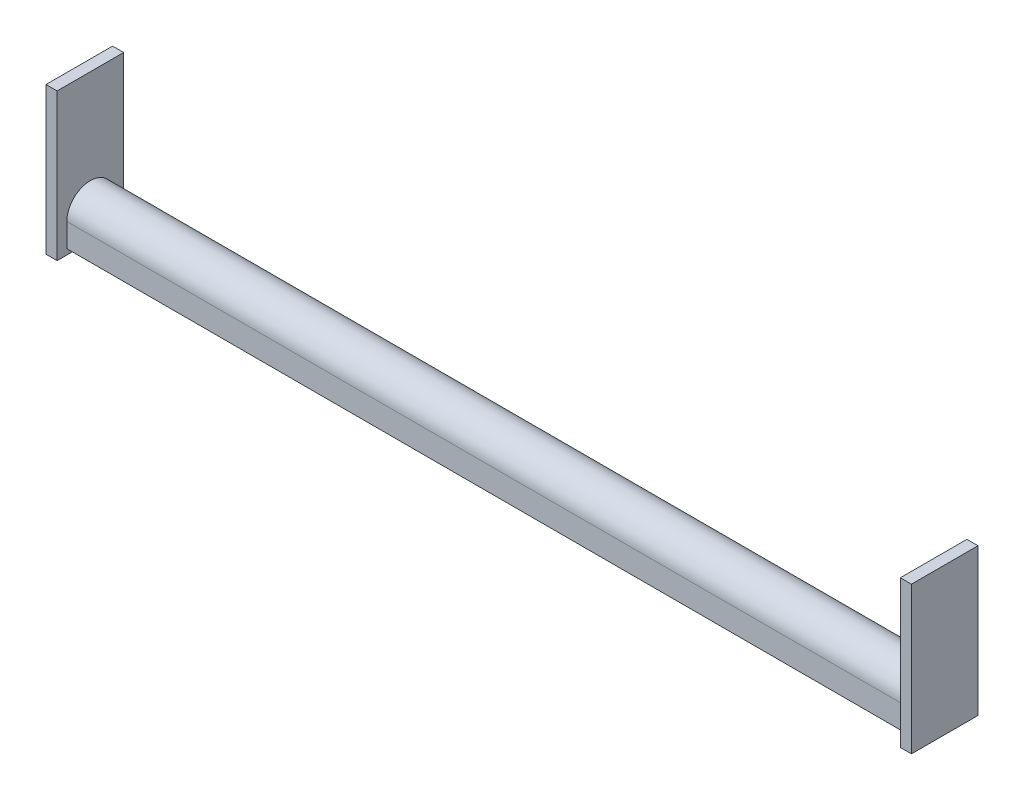
ISO-10303-21;
HEADER;
FILE_DESCRIPTION(('STEP AP214'),'2;1');
FILE_NAME('part.step','',(''),(''),'','','');
FILE_SCHEMA(('AUTOMOTIVE_DESIGN { 1 0 10303 214 1 1 1 1 }'));
ENDSEC;
DATA;
#1=APPLICATION_CONTEXT('core data for automotive mechanical design processes');
#2=APPLICATION_PROTOCOL_DEFINITION('international standard','automotive_design',2000,#1);
#3=PRODUCT_CONTEXT('',#1,'mechanical');
#4=PRODUCT('Part','Part','',(#3));
#5=PRODUCT_RELATED_PRODUCT_CATEGORY('part','',(#4));
#6=PRODUCT_DEFINITION_FORMATION('','',#4);
#7=PRODUCT_DEFINITION_CONTEXT('part definition',#1,'design');
#8=PRODUCT_DEFINITION('design','',#6,#7);
#9=PRODUCT_DEFINITION_SHAPE('','',#8);
#10=(LENGTH_UNIT() NAMED_UNIT(*) SI_UNIT(.MILLI.,.METRE.));
#11=(NAMED_UNIT(*) PLANE_ANGLE_UNIT() SI_UNIT($,.RADIAN.));
#12=(NAMED_UNIT(*) SI_UNIT($,.STERADIAN.) SOLID_ANGLE_UNIT());
#13=UNCERTAINTY_MEASURE_WITH_UNIT(LENGTH_MEASURE(1.E-05),#10,'distance_accuracy_value','');
#14=(GEOMETRIC_REPRESENTATION_CONTEXT(3) GLOBAL_UNCERTAINTY_ASSIGNED_CONTEXT((#13)) GLOBAL_UNIT_ASSIGNED_CONTEXT((#10,
#11,#12)) REPRESENTATION_CONTEXT('',''));
#15=CARTESIAN_POINT('',(0.,0.,0.));
#16=DIRECTION('',(0.,0.,1.));
#17=DIRECTION('',(1.,0.,0.));
#18=AXIS2_PLACEMENT_3D('',#15,#16,#17);
#19=CARTESIAN_POINT('',(0.,0.,0.));
#20=DIRECTION('',(1.,0.,0.));
#21=DIRECTION('',(0.,0.,-1.));
#22=AXIS2_PLACEMENT_3D('',#19,#20,#21);
#23=PLANE('',#22);
#24=DIRECTION('',(0.,1.,0.));
#25=VECTOR('',#24,1.);
#26=CARTESIAN_POINT('',(0.,84.1375,-38.1));
#27=LINE('',#26,#25);
#28=CARTESIAN_POINT('',(0.,-84.1375,-38.1));
#29=VERTEX_POINT('',#28);
#30=CARTESIAN_POINT('',(0.,84.1375,-38.1));
#31=VERTEX_POINT('',#30);
#32=EDGE_CURVE('E240',#29,#31,#27,.T.);
#33=ORIENTED_EDGE('',*,*,#32,.F.);
#34=DIRECTION('',(0.,0.,-1.));
#35=VECTOR('',#34,1.);
#36=CARTESIAN_POINT('',(0.,-84.1375,38.1));
#37=LINE('',#36,#35);
#38=CARTESIAN_POINT('',(0.,-84.1375,38.1));
#39=VERTEX_POINT('',#38);
#40=EDGE_CURVE('E245',#39,#29,#37,.T.);
#41=ORIENTED_EDGE('',*,*,#40,.F.);
#42=DIRECTION('',(0.,-1.,0.));
#43=VECTOR('',#42,1.);
#44=CARTESIAN_POINT('',(0.,84.1375,38.1));
#45=LINE('',#44,#43);
#46=CARTESIAN_POINT('',(0.,84.1375,38.1));
#47=VERTEX_POINT('',#46);
#48=EDGE_CURVE('E256',#47,#39,#45,.T.);
#49=ORIENTED_EDGE('',*,*,#48,.F.);
#50=DIRECTION('',(0.,0.,1.));
#51=VECTOR('',#50,1.);
#52=CARTESIAN_POINT('',(0.,84.1375,38.1));
#53=LINE('',#52,#51);
#54=EDGE_CURVE('E254',#31,#47,#53,.T.);
#55=ORIENTED_EDGE('',*,*,#54,.F.);
#56=EDGE_LOOP('',(#33,#41,#49,#55));
#57=FACE_BOUND('',#56,.T.);
#58=DIRECTION('',(0.,0.,1.));
#59=VECTOR('',#58,1.);
#60=CARTESIAN_POINT('',(0.,-77.7875,-26.9875));
#61=LINE('',#60,#59);
#62=CARTESIAN_POINT('',(0.,-77.7875,-26.9875));
#63=VERTEX_POINT('',#62);
#64=CARTESIAN_POINT('',(0.,-77.7875,-22.9235));
#65=VERTEX_POINT('',#64);
#66=EDGE_CURVE('E168',#63,#65,#61,.T.);
#67=ORIENTED_EDGE('',*,*,#66,.F.);
#68=DIRECTION('',(0.,-1.,0.));
#69=VECTOR('',#68,1.);
#70=CARTESIAN_POINT('',(0.,-77.7875,-26.9875));
#71=LINE('',#70,#69);
#72=CARTESIAN_POINT('',(0.,-50.8,-26.9875));
#73=VERTEX_POINT('',#72);
#74=EDGE_CURVE('E180',#73,#63,#71,.T.);
#75=ORIENTED_EDGE('',*,*,#74,.F.);
#76=CARTESIAN_POINT('',(0.,-50.8,0.));
#77=DIRECTION('',(-1.,0.,0.));
#78=DIRECTION('',(0.,0.,-1.));
#79=AXIS2_PLACEMENT_3D('',#76,#77,#78);
#80=CIRCLE('',#79,26.9875);
#81=CARTESIAN_POINT('',(0.,-50.8,26.9875));
#82=VERTEX_POINT('',#81);
#83=EDGE_CURVE('E213',#82,#73,#80,.T.);
#84=ORIENTED_EDGE('',*,*,#83,.F.);
#85=DIRECTION('',(0.,1.,0.));
#86=VECTOR('',#85,1.);
#87=CARTESIAN_POINT('',(0.,-77.7875,26.9875));
#88=LINE('',#87,#86);
#89=CARTESIAN_POINT('',(0.,-77.7875,26.9875));
#90=VERTEX_POINT('',#89);
#91=EDGE_CURVE('E210',#90,#82,#88,.T.);
#92=ORIENTED_EDGE('',*,*,#91,.F.);
#93=DIRECTION('',(0.,0.,1.));
#94=VECTOR('',#93,1.);
#95=CARTESIAN_POINT('',(0.,-77.7875,22.9235));
#96=LINE('',#95,#94);
#97=CARTESIAN_POINT('',(0.,-77.7875,22.9235));
#98=VERTEX_POINT('',#97);
#99=EDGE_CURVE('E207',#98,#90,#96,.T.);
#100=ORIENTED_EDGE('',*,*,#99,.F.);
#101=DIRECTION('',(0.,-1.,0.));
#102=VECTOR('',#101,1.);
#103=CARTESIAN_POINT('',(0.,-50.8,22.9235));
#104=LINE('',#103,#102);
#105=CARTESIAN_POINT('',(0.,-50.8,22.9235));
#106=VERTEX_POINT('',#105);
#107=EDGE_CURVE('E204',#106,#98,#104,.T.);
#108=ORIENTED_EDGE('',*,*,#107,.F.);
#109=CARTESIAN_POINT('',(0.,-50.8,0.));
#110=DIRECTION('',(1.,0.,0.));
#111=DIRECTION('',(0.,0.,-1.));
#112=AXIS2_PLACEMENT_3D('',#109,#110,#111);
#113=CIRCLE('',#112,22.9235);
#114=CARTESIAN_POINT('',(0.,-50.8,-22.9235));
#115=VERTEX_POINT('',#114);
#116=EDGE_CURVE('E52',#115,#106,#113,.T.);
#117=ORIENTED_EDGE('',*,*,#116,.F.);
#118=DIRECTION('',(0.,1.,0.));
#119=VECTOR('',#118,1.);
#120=CARTESIAN_POINT('',(0.,-77.7875,-22.9235));
#121=LINE('',#120,#119);
#122=EDGE_CURVE('E47',#65,#115,#121,.T.);
#123=ORIENTED_EDGE('',*,*,#122,.F.);
#124=EDGE_LOOP('',(#67,#75,#84,#92,#100,#108,#117,#123));
#125=FACE_BOUND('',#124,.T.);
#126=ADVANCED_FACE('F32',(#57,#125),#23,.F.);
#127=CARTESIAN_POINT('',(12.7,84.1375,-38.1));
#128=DIRECTION('',(0.,0.,1.));
#129=DIRECTION('',(0.,-1.,0.));
#130=AXIS2_PLACEMENT_3D('',#127,#128,#129);
#131=PLANE('',#130);
#132=ORIENTED_EDGE('',*,*,#32,.T.);
#133=DIRECTION('',(-1.,0.,0.));
#134=VECTOR('',#133,1.);
#135=CARTESIAN_POINT('',(12.7,84.1375,-38.1));
#136=LINE('',#135,#134);
#137=CARTESIAN_POINT('',(12.7,84.1375,-38.1));
#138=VERTEX_POINT('',#137);
#139=EDGE_CURVE('E11',#138,#31,#136,.T.);
#140=ORIENTED_EDGE('',*,*,#139,.F.);
#141=DIRECTION('',(0.,1.,0.));
#142=VECTOR('',#141,1.);
#143=CARTESIAN_POINT('',(12.7,84.1375,-38.1));
#144=LINE('',#143,#142);
#145=CARTESIAN_POINT('',(12.7,-84.1375,-38.1));
#146=VERTEX_POINT('',#145);
#147=EDGE_CURVE('E241',#146,#138,#144,.T.);
#148=ORIENTED_EDGE('',*,*,#147,.F.);
#149=DIRECTION('',(-1.,0.,0.));
#150=VECTOR('',#149,1.);
#151=CARTESIAN_POINT('',(12.7,-84.1375,-38.1));
#152=LINE('',#151,#150);
#153=EDGE_CURVE('E251',#146,#29,#152,.T.);
#154=ORIENTED_EDGE('',*,*,#153,.T.);
#155=EDGE_LOOP('',(#132,#140,#148,#154));
#156=FACE_BOUND('',#155,.T.);
#157=ADVANCED_FACE('F34',(#156),#131,.F.);
#158=CARTESIAN_POINT('',(12.7,84.1375,38.1));
#159=DIRECTION('',(0.,-1.,0.));
#160=DIRECTION('',(0.,0.,-1.));
#161=AXIS2_PLACEMENT_3D('',#158,#159,#160);
#162=PLANE('',#161);
#163=ORIENTED_EDGE('',*,*,#54,.T.);
#164=DIRECTION('',(-1.,0.,0.));
#165=VECTOR('',#164,1.);
#166=CARTESIAN_POINT('',(12.7,84.1375,38.1));
#167=LINE('',#166,#165);
#168=CARTESIAN_POINT('',(12.7,84.1375,38.1));
#169=VERTEX_POINT('',#168);
#170=EDGE_CURVE('E40',#169,#47,#167,.T.);
#171=ORIENTED_EDGE('',*,*,#170,.F.);
#172=DIRECTION('',(0.,0.,1.));
#173=VECTOR('',#172,1.);
#174=CARTESIAN_POINT('',(12.7,84.1375,38.1));
#175=LINE('',#174,#173);
#176=EDGE_CURVE('E244',#138,#169,#175,.T.);
#177=ORIENTED_EDGE('',*,*,#176,.F.);
#178=ORIENTED_EDGE('',*,*,#139,.T.);
#179=EDGE_LOOP('',(#163,#171,#177,#178));
#180=FACE_BOUND('',#179,.T.);
#181=ADVANCED_FACE('F283',(#180),#162,.F.);
#182=CARTESIAN_POINT('',(12.7,84.1375,38.1));
#183=DIRECTION('',(0.,0.,-1.));
#184=DIRECTION('',(0.,1.,0.));
#185=AXIS2_PLACEMENT_3D('',#182,#183,#184);
#186=PLANE('',#185);
#187=ORIENTED_EDGE('',*,*,#48,.T.);
#188=DIRECTION('',(-1.,0.,0.));
#189=VECTOR('',#188,1.);
#190=CARTESIAN_POINT('',(12.7,-84.1375,38.1));
#191=LINE('',#190,#189);
#192=CARTESIAN_POINT('',(12.7,-84.1375,38.1));
#193=VERTEX_POINT('',#192);
#194=EDGE_CURVE('E261',#193,#39,#191,.T.);
#195=ORIENTED_EDGE('',*,*,#194,.F.);
#196=DIRECTION('',(0.,-1.,0.));
#197=VECTOR('',#196,1.);
#198=CARTESIAN_POINT('',(12.7,84.1375,38.1));
#199=LINE('',#198,#197);
#200=EDGE_CURVE('E247',#169,#193,#199,.T.);
#201=ORIENTED_EDGE('',*,*,#200,.F.);
#202=ORIENTED_EDGE('',*,*,#170,.T.);
#203=EDGE_LOOP('',(#187,#195,#201,#202));
#204=FACE_BOUND('',#203,.T.);
#205=ADVANCED_FACE('F268',(#204),#186,.F.);
#206=CARTESIAN_POINT('',(12.7,-84.1375,38.1));
#207=DIRECTION('',(0.,1.,0.));
#208=DIRECTION('',(0.,0.,1.));
#209=AXIS2_PLACEMENT_3D('',#206,#207,#208);
#210=PLANE('',#209);
#211=ORIENTED_EDGE('',*,*,#40,.T.);
#212=ORIENTED_EDGE('',*,*,#153,.F.);
#213=DIRECTION('',(0.,0.,-1.));
#214=VECTOR('',#213,1.);
#215=CARTESIAN_POINT('',(12.7,-84.1375,38.1));
#216=LINE('',#215,#214);
#217=EDGE_CURVE('E249',#193,#146,#216,.T.);
#218=ORIENTED_EDGE('',*,*,#217,.F.);
#219=ORIENTED_EDGE('',*,*,#194,.T.);
#220=EDGE_LOOP('',(#211,#212,#218,#219));
#221=FACE_BOUND('',#220,.T.);
#222=ADVANCED_FACE('F276',(#221),#210,.F.);
#223=CARTESIAN_POINT('',(12.7,0.,0.));
#224=DIRECTION('',(1.,0.,0.));
#225=DIRECTION('',(0.,0.,-1.));
#226=AXIS2_PLACEMENT_3D('',#223,#224,#225);
#227=PLANE('',#226);
#228=ORIENTED_EDGE('',*,*,#147,.T.);
#229=ORIENTED_EDGE('',*,*,#176,.T.);
#230=ORIENTED_EDGE('',*,*,#200,.T.);
#231=ORIENTED_EDGE('',*,*,#217,.T.);
#232=EDGE_LOOP('',(#228,#229,#230,#231));
#233=FACE_BOUND('',#232,.T.);
#234=ADVANCED_FACE('F282',(#233),#227,.T.);
#235=CARTESIAN_POINT('',(-965.2,-77.7875,-26.9875));
#236=DIRECTION('',(0.,1.,0.));
#237=DIRECTION('',(0.,0.,1.));
#238=AXIS2_PLACEMENT_3D('',#235,#236,#237);
#239=PLANE('',#238);
#240=ORIENTED_EDGE('',*,*,#66,.T.);
#241=DIRECTION('',(1.,0.,0.));
#242=VECTOR('',#241,1.);
#243=CARTESIAN_POINT('',(-965.2,-77.7875,-22.9235));
#244=LINE('',#243,#242);
#245=CARTESIAN_POINT('',(-965.2,-77.7875,-22.9235));
#246=VERTEX_POINT('',#245);
#247=EDGE_CURVE('E238',#246,#65,#244,.T.);
#248=ORIENTED_EDGE('',*,*,#247,.F.);
#249=DIRECTION('',(0.,0.,1.));
#250=VECTOR('',#249,1.);
#251=CARTESIAN_POINT('',(-965.2,-77.7875,-26.9875));
#252=LINE('',#251,#250);
#253=CARTESIAN_POINT('',(-965.2,-77.7875,-26.9875));
#254=VERTEX_POINT('',#253);
#255=EDGE_CURVE('E176',#254,#246,#252,.T.);
#256=ORIENTED_EDGE('',*,*,#255,.F.);
#257=DIRECTION('',(1.,0.,0.));
#258=VECTOR('',#257,1.);
#259=CARTESIAN_POINT('',(-965.2,-77.7875,-26.9875));
#260=LINE('',#259,#258);
#261=EDGE_CURVE('E200',#254,#63,#260,.T.);
#262=ORIENTED_EDGE('',*,*,#261,.T.);
#263=EDGE_LOOP('',(#240,#248,#256,#262));
#264=FACE_BOUND('',#263,.T.);
#265=ADVANCED_FACE('F301',(#264),#239,.F.);
#266=CARTESIAN_POINT('',(-965.2,-77.7875,-22.9235));
#267=DIRECTION('',(0.,0.,-1.));
#268=DIRECTION('',(0.,1.,0.));
#269=AXIS2_PLACEMENT_3D('',#266,#267,#268);
#270=PLANE('',#269);
#271=ORIENTED_EDGE('',*,*,#122,.T.);
#272=DIRECTION('',(1.,0.,0.));
#273=VECTOR('',#272,1.);
#274=CARTESIAN_POINT('',(-965.2,-50.8,-22.9235));
#275=LINE('',#274,#273);
#276=CARTESIAN_POINT('',(-965.2,-50.8,-22.9235));
#277=VERTEX_POINT('',#276);
#278=EDGE_CURVE('E235',#277,#115,#275,.T.);
#279=ORIENTED_EDGE('',*,*,#278,.F.);
#280=DIRECTION('',(0.,1.,0.));
#281=VECTOR('',#280,1.);
#282=CARTESIAN_POINT('',(-965.2,-77.7875,-22.9235));
#283=LINE('',#282,#281);
#284=EDGE_CURVE('E179',#246,#277,#283,.T.);
#285=ORIENTED_EDGE('',*,*,#284,.F.);
#286=ORIENTED_EDGE('',*,*,#247,.T.);
#287=EDGE_LOOP('',(#271,#279,#285,#286));
#288=FACE_BOUND('',#287,.T.);
#289=ADVANCED_FACE('F305',(#288),#270,.F.);
#290=CARTESIAN_POINT('',(-965.2,-50.8,0.));
#291=DIRECTION('',(1.,0.,0.));
#292=DIRECTION('',(0.,0.,-1.));
#293=AXIS2_PLACEMENT_3D('',#290,#291,#292);
#294=CYLINDRICAL_SURFACE('',#293,22.9235);
#295=ORIENTED_EDGE('',*,*,#116,.T.);
#296=DIRECTION('',(1.,0.,0.));
#297=VECTOR('',#296,1.);
#298=CARTESIAN_POINT('',(-965.2,-50.8,22.9235));
#299=LINE('',#298,#297);
#300=CARTESIAN_POINT('',(-965.2,-50.8,22.9235));
#301=VERTEX_POINT('',#300);
#302=EDGE_CURVE('E232',#301,#106,#299,.T.);
#303=ORIENTED_EDGE('',*,*,#302,.F.);
#304=CARTESIAN_POINT('',(-965.2,-50.8,0.));
#305=DIRECTION('',(1.,0.,0.));
#306=DIRECTION('',(0.,0.,-1.));
#307=AXIS2_PLACEMENT_3D('',#304,#305,#306);
#308=CIRCLE('',#307,22.9235);
#309=EDGE_CURVE('E183',#277,#301,#308,.T.);
#310=ORIENTED_EDGE('',*,*,#309,.F.);
#311=ORIENTED_EDGE('',*,*,#278,.T.);
#312=EDGE_LOOP('',(#295,#303,#310,#311));
#313=FACE_BOUND('',#312,.T.);
#314=ADVANCED_FACE('F310',(#313),#294,.F.);
#315=CARTESIAN_POINT('',(-965.2,-50.8,22.9235));
#316=DIRECTION('',(0.,0.,1.));
#317=DIRECTION('',(0.,-1.,0.));
#318=AXIS2_PLACEMENT_3D('',#315,#316,#317);
#319=PLANE('',#318);
#320=ORIENTED_EDGE('',*,*,#107,.T.);
#321=DIRECTION('',(1.,0.,0.));
#322=VECTOR('',#321,1.);
#323=CARTESIAN_POINT('',(-965.2,-77.7875,22.9235));
#324=LINE('',#323,#322);
#325=CARTESIAN_POINT('',(-965.2,-77.7875,22.9235));
#326=VERTEX_POINT('',#325);
#327=EDGE_CURVE('E229',#326,#98,#324,.T.);
#328=ORIENTED_EDGE('',*,*,#327,.F.);
#329=DIRECTION('',(0.,-1.,0.));
#330=VECTOR('',#329,1.);
#331=CARTESIAN_POINT('',(-965.2,-50.8,22.9235));
#332=LINE('',#331,#330);
#333=EDGE_CURVE('E186',#301,#326,#332,.T.);
#334=ORIENTED_EDGE('',*,*,#333,.F.);
#335=ORIENTED_EDGE('',*,*,#302,.T.);
#336=EDGE_LOOP('',(#320,#328,#334,#335));
#337=FACE_BOUND('',#336,.T.);
#338=ADVANCED_FACE('F316',(#337),#319,.F.);
#339=CARTESIAN_POINT('',(-965.2,-77.7875,22.9235));
#340=DIRECTION('',(0.,1.,0.));
#341=DIRECTION('',(0.,0.,1.));
#342=AXIS2_PLACEMENT_3D('',#339,#340,#341);
#343=PLANE('',#342);
#344=ORIENTED_EDGE('',*,*,#99,.T.);
#345=DIRECTION('',(1.,0.,0.));
#346=VECTOR('',#345,1.);
#347=CARTESIAN_POINT('',(-965.2,-77.7875,26.9875));
#348=LINE('',#347,#346);
#349=CARTESIAN_POINT('',(-965.2,-77.7875,26.9875));
#350=VERTEX_POINT('',#349);
#351=EDGE_CURVE('E226',#350,#90,#348,.T.);
#352=ORIENTED_EDGE('',*,*,#351,.F.);
#353=DIRECTION('',(0.,0.,1.));
#354=VECTOR('',#353,1.);
#355=CARTESIAN_POINT('',(-965.2,-77.7875,22.9235));
#356=LINE('',#355,#354);
#357=EDGE_CURVE('E189',#326,#350,#356,.T.);
#358=ORIENTED_EDGE('',*,*,#357,.F.);
#359=ORIENTED_EDGE('',*,*,#327,.T.);
#360=EDGE_LOOP('',(#344,#352,#358,#359));
#361=FACE_BOUND('',#360,.T.);
#362=ADVANCED_FACE('F320',(#361),#343,.F.);
#363=CARTESIAN_POINT('',(-965.2,-77.7875,26.9875));
#364=DIRECTION('',(0.,0.,-1.));
#365=DIRECTION('',(0.,1.,0.));
#366=AXIS2_PLACEMENT_3D('',#363,#364,#365);
#367=PLANE('',#366);
#368=ORIENTED_EDGE('',*,*,#91,.T.);
#369=DIRECTION('',(1.,0.,0.));
#370=VECTOR('',#369,1.);
#371=CARTESIAN_POINT('',(-965.2,-50.8,26.9875));
#372=LINE('',#371,#370);
#373=CARTESIAN_POINT('',(-965.2,-50.8,26.9875));
#374=VERTEX_POINT('',#373);
#375=EDGE_CURVE('E223',#374,#82,#372,.T.);
#376=ORIENTED_EDGE('',*,*,#375,.F.);
#377=DIRECTION('',(0.,1.,0.));
#378=VECTOR('',#377,1.);
#379=CARTESIAN_POINT('',(-965.2,-77.7875,26.9875));
#380=LINE('',#379,#378);
#381=EDGE_CURVE('E192',#350,#374,#380,.T.);
#382=ORIENTED_EDGE('',*,*,#381,.F.);
#383=ORIENTED_EDGE('',*,*,#351,.T.);
#384=EDGE_LOOP('',(#368,#376,#382,#383));
#385=FACE_BOUND('',#384,.T.);
#386=ADVANCED_FACE('F324',(#385),#367,.F.);
#387=CARTESIAN_POINT('',(-965.2,-50.8,0.));
#388=DIRECTION('',(1.,0.,0.));
#389=DIRECTION('',(0.,0.,-1.));
#390=AXIS2_PLACEMENT_3D('',#387,#388,#389);
#391=CYLINDRICAL_SURFACE('',#390,26.9875);
#392=ORIENTED_EDGE('',*,*,#83,.T.);
#393=DIRECTION('',(1.,0.,0.));
#394=VECTOR('',#393,1.);
#395=CARTESIAN_POINT('',(-965.2,-50.8,-26.9875));
#396=LINE('',#395,#394);
#397=CARTESIAN_POINT('',(-965.2,-50.8,-26.9875));
#398=VERTEX_POINT('',#397);
#399=EDGE_CURVE('E220',#398,#73,#396,.T.);
#400=ORIENTED_EDGE('',*,*,#399,.F.);
#401=CARTESIAN_POINT('',(-965.2,-50.8,0.));
#402=DIRECTION('',(-1.,0.,0.));
#403=DIRECTION('',(0.,0.,-1.));
#404=AXIS2_PLACEMENT_3D('',#401,#402,#403);
#405=CIRCLE('',#404,26.9875);
#406=EDGE_CURVE('E195',#374,#398,#405,.T.);
#407=ORIENTED_EDGE('',*,*,#406,.F.);
#408=ORIENTED_EDGE('',*,*,#375,.T.);
#409=EDGE_LOOP('',(#392,#400,#407,#408));
#410=FACE_BOUND('',#409,.T.);
#411=ADVANCED_FACE('F328',(#410),#391,.T.);
#412=CARTESIAN_POINT('',(-965.2,-77.7875,-26.9875));
#413=DIRECTION('',(0.,0.,1.));
#414=DIRECTION('',(0.,-1.,0.));
#415=AXIS2_PLACEMENT_3D('',#412,#413,#414);
#416=PLANE('',#415);
#417=ORIENTED_EDGE('',*,*,#74,.T.);
#418=ORIENTED_EDGE('',*,*,#261,.F.);
#419=DIRECTION('',(0.,-1.,0.));
#420=VECTOR('',#419,1.);
#421=CARTESIAN_POINT('',(-965.2,-77.7875,-26.9875));
#422=LINE('',#421,#420);
#423=EDGE_CURVE('E198',#398,#254,#422,.T.);
#424=ORIENTED_EDGE('',*,*,#423,.F.);
#425=ORIENTED_EDGE('',*,*,#399,.T.);
#426=EDGE_LOOP('',(#417,#418,#424,#425));
#427=FACE_BOUND('',#426,.T.);
#428=ADVANCED_FACE('F332',(#427),#416,.F.);
#429=CARTESIAN_POINT('',(-965.2,0.,0.));
#430=DIRECTION('',(-1.,0.,0.));
#431=DIRECTION('',(0.,0.,1.));
#432=AXIS2_PLACEMENT_3D('',#429,#430,#431);
#433=PLANE('',#432);
#434=DIRECTION('',(0.,0.,-1.));
#435=VECTOR('',#434,1.);
#436=CARTESIAN_POINT('',(-965.2,84.1375,38.1));
#437=LINE('',#436,#435);
#438=CARTESIAN_POINT('',(-965.2,84.1375,38.1));
#439=VERTEX_POINT('',#438);
#440=CARTESIAN_POINT('',(-965.2,84.1375,-38.1));
#441=VERTEX_POINT('',#440);
#442=EDGE_CURVE('E167',#439,#441,#437,.T.);
#443=ORIENTED_EDGE('',*,*,#442,.F.);
#444=DIRECTION('',(0.,1.,0.));
#445=VECTOR('',#444,1.);
#446=CARTESIAN_POINT('',(-965.2,-84.1375,38.1));
#447=LINE('',#446,#445);
#448=CARTESIAN_POINT('',(-965.2,-84.1375,38.1));
#449=VERTEX_POINT('',#448);
#450=EDGE_CURVE('E163',#449,#439,#447,.T.);
#451=ORIENTED_EDGE('',*,*,#450,.F.);
#452=DIRECTION('',(0.,0.,1.));
#453=VECTOR('',#452,1.);
#454=CARTESIAN_POINT('',(-965.2,-84.1375,-38.1));
#455=LINE('',#454,#453);
#456=CARTESIAN_POINT('',(-965.2,-84.1375,-38.1));
#457=VERTEX_POINT('',#456);
#458=EDGE_CURVE('E477',#457,#449,#455,.T.);
#459=ORIENTED_EDGE('',*,*,#458,.F.);
#460=DIRECTION('',(0.,-1.,0.));
#461=VECTOR('',#460,1.);
#462=CARTESIAN_POINT('',(-965.2,84.1375,-38.1));
#463=LINE('',#462,#461);
#464=EDGE_CURVE('E475',#441,#457,#463,.T.);
#465=ORIENTED_EDGE('',*,*,#464,.F.);
#466=EDGE_LOOP('',(#443,#451,#459,#465));
#467=FACE_BOUND('',#466,.T.);
#468=ORIENTED_EDGE('',*,*,#423,.T.);
#469=ORIENTED_EDGE('',*,*,#255,.T.);
#470=ORIENTED_EDGE('',*,*,#284,.T.);
#471=ORIENTED_EDGE('',*,*,#309,.T.);
#472=ORIENTED_EDGE('',*,*,#333,.T.);
#473=ORIENTED_EDGE('',*,*,#357,.T.);
#474=ORIENTED_EDGE('',*,*,#381,.T.);
#475=ORIENTED_EDGE('',*,*,#406,.T.);
#476=EDGE_LOOP('',(#468,#469,#470,#471,#472,#473,#474,#475));
#477=FACE_BOUND('',#476,.T.);
#478=ADVANCED_FACE('F336',(#467,#477),#433,.F.);
#479=CARTESIAN_POINT('',(-977.9,84.1375,38.1));
#480=DIRECTION('',(0.,-1.,0.));
#481=DIRECTION('',(0.,0.,-1.));
#482=AXIS2_PLACEMENT_3D('',#479,#480,#481);
#483=PLANE('',#482);
#484=ORIENTED_EDGE('',*,*,#442,.T.);
#485=DIRECTION('',(1.,0.,0.));
#486=VECTOR('',#485,1.);
#487=CARTESIAN_POINT('',(-977.9,84.1375,-38.1));
#488=LINE('',#487,#486);
#489=CARTESIAN_POINT('',(-977.9,84.1375,-38.1));
#490=VERTEX_POINT('',#489);
#491=EDGE_CURVE('E147',#490,#441,#488,.T.);
#492=ORIENTED_EDGE('',*,*,#491,.F.);
#493=DIRECTION('',(0.,0.,-1.));
#494=VECTOR('',#493,1.);
#495=CARTESIAN_POINT('',(-977.9,84.1375,38.1));
#496=LINE('',#495,#494);
#497=CARTESIAN_POINT('',(-977.9,84.1375,38.1));
#498=VERTEX_POINT('',#497);
#499=EDGE_CURVE('E154',#498,#490,#496,.T.);
#500=ORIENTED_EDGE('',*,*,#499,.F.);
#501=DIRECTION('',(1.,0.,0.));
#502=VECTOR('',#501,1.);
#503=CARTESIAN_POINT('',(-977.9,84.1375,38.1));
#504=LINE('',#503,#502);
#505=EDGE_CURVE('E484',#498,#439,#504,.T.);
#506=ORIENTED_EDGE('',*,*,#505,.T.);
#507=EDGE_LOOP('',(#484,#492,#500,#506));
#508=FACE_BOUND('',#507,.T.);
#509=ADVANCED_FACE('F165',(#508),#483,.F.);
#510=CARTESIAN_POINT('',(-977.9,84.1375,-38.1));
#511=DIRECTION('',(0.,0.,1.));
#512=DIRECTION('',(0.,-1.,0.));
#513=AXIS2_PLACEMENT_3D('',#510,#511,#512);
#514=PLANE('',#513);
#515=ORIENTED_EDGE('',*,*,#464,.T.);
#516=DIRECTION('',(1.,0.,0.));
#517=VECTOR('',#516,1.);
#518=CARTESIAN_POINT('',(-977.9,-84.1375,-38.1));
#519=LINE('',#518,#517);
#520=CARTESIAN_POINT('',(-977.9,-84.1375,-38.1));
#521=VERTEX_POINT('',#520);
#522=EDGE_CURVE('E150',#521,#457,#519,.T.);
#523=ORIENTED_EDGE('',*,*,#522,.F.);
#524=DIRECTION('',(0.,-1.,0.));
#525=VECTOR('',#524,1.);
#526=CARTESIAN_POINT('',(-977.9,84.1375,-38.1));
#527=LINE('',#526,#525);
#528=EDGE_CURVE('E143',#490,#521,#527,.T.);
#529=ORIENTED_EDGE('',*,*,#528,.F.);
#530=ORIENTED_EDGE('',*,*,#491,.T.);
#531=EDGE_LOOP('',(#515,#523,#529,#530));
#532=FACE_BOUND('',#531,.T.);
#533=ADVANCED_FACE('F145',(#532),#514,.F.);
#534=CARTESIAN_POINT('',(-977.9,-84.1375,-38.1));
#535=DIRECTION('',(0.,1.,0.));
#536=DIRECTION('',(0.,0.,1.));
#537=AXIS2_PLACEMENT_3D('',#534,#535,#536);
#538=PLANE('',#537);
#539=ORIENTED_EDGE('',*,*,#458,.T.);
#540=DIRECTION('',(1.,0.,0.));
#541=VECTOR('',#540,1.);
#542=CARTESIAN_POINT('',(-977.9,-84.1375,38.1));
#543=LINE('',#542,#541);
#544=CARTESIAN_POINT('',(-977.9,-84.1375,38.1));
#545=VERTEX_POINT('',#544);
#546=EDGE_CURVE('E172',#545,#449,#543,.T.);
#547=ORIENTED_EDGE('',*,*,#546,.F.);
#548=DIRECTION('',(0.,0.,1.));
#549=VECTOR('',#548,1.);
#550=CARTESIAN_POINT('',(-977.9,-84.1375,-38.1));
#551=LINE('',#550,#549);
#552=EDGE_CURVE('E153',#521,#545,#551,.T.);
#553=ORIENTED_EDGE('',*,*,#552,.F.);
#554=ORIENTED_EDGE('',*,*,#522,.T.);
#555=EDGE_LOOP('',(#539,#547,#553,#554));
#556=FACE_BOUND('',#555,.T.);
#557=ADVANCED_FACE('F342',(#556),#538,.F.);
#558=CARTESIAN_POINT('',(-977.9,-84.1375,38.1));
#559=DIRECTION('',(0.,0.,-1.));
#560=DIRECTION('',(0.,1.,0.));
#561=AXIS2_PLACEMENT_3D('',#558,#559,#560);
#562=PLANE('',#561);
#563=ORIENTED_EDGE('',*,*,#450,.T.);
#564=ORIENTED_EDGE('',*,*,#505,.F.);
#565=DIRECTION('',(0.,1.,0.));
#566=VECTOR('',#565,1.);
#567=CARTESIAN_POINT('',(-977.9,-84.1375,38.1));
#568=LINE('',#567,#566);
#569=EDGE_CURVE('E159',#545,#498,#568,.T.);
#570=ORIENTED_EDGE('',*,*,#569,.F.);
#571=ORIENTED_EDGE('',*,*,#546,.T.);
#572=EDGE_LOOP('',(#563,#564,#570,#571));
#573=FACE_BOUND('',#572,.T.);
#574=ADVANCED_FACE('F345',(#573),#562,.F.);
#575=CARTESIAN_POINT('',(-977.9,0.,0.));
#576=DIRECTION('',(-1.,0.,0.));
#577=DIRECTION('',(0.,0.,1.));
#578=AXIS2_PLACEMENT_3D('',#575,#576,#577);
#579=PLANE('',#578);
#580=ORIENTED_EDGE('',*,*,#499,.T.);
#581=ORIENTED_EDGE('',*,*,#528,.T.);
#582=ORIENTED_EDGE('',*,*,#552,.T.);
#583=ORIENTED_EDGE('',*,*,#569,.T.);
#584=EDGE_LOOP('',(#580,#581,#582,#583));
#585=FACE_BOUND('',#584,.T.);
#586=ADVANCED_FACE('F157',(#585),#579,.T.);
#587=CLOSED_SHELL('',(#126,#157,#181,#205,#222,#234,#265,#289,#314,#338,#362,#386,#411,#428,
#478,#509,#533,#557,#574,#586));
#588=MANIFOLD_SOLID_BREP('B2',#587);
#589=ADVANCED_BREP_SHAPE_REPRESENTATION('',(#18,#588),#14);
#590=SHAPE_DEFINITION_REPRESENTATION(#9,#589);
ENDSEC;
END-ISO-10303-21;
